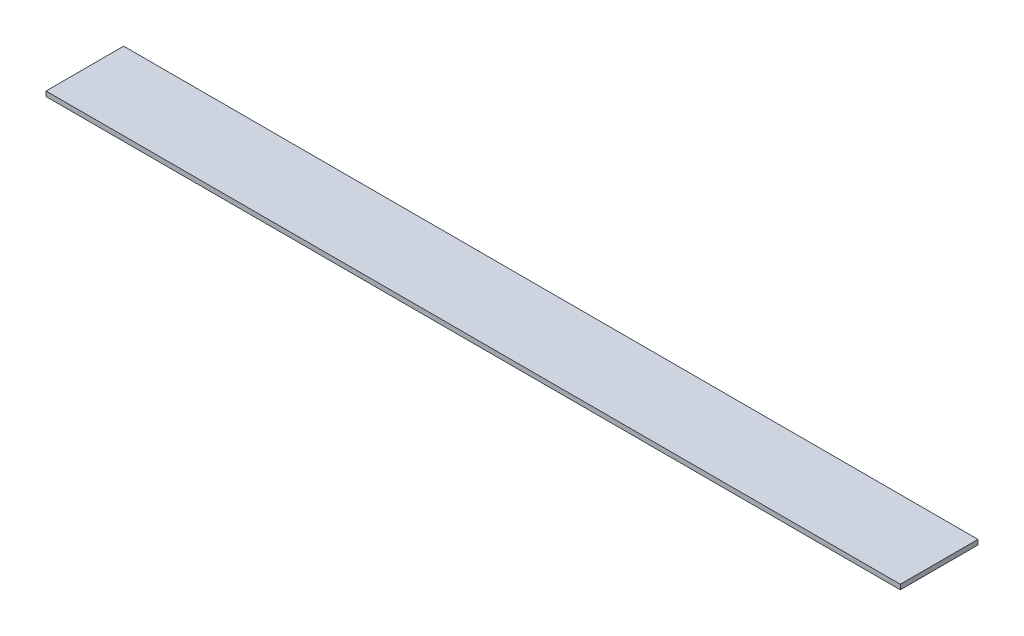
ISO-10303-21;
HEADER;
FILE_DESCRIPTION(('STEP AP214'),'2;1');
FILE_NAME('part.step','',(''),(''),'','','');
FILE_SCHEMA(('AUTOMOTIVE_DESIGN { 1 0 10303 214 1 1 1 1 }'));
ENDSEC;
DATA;
#1=APPLICATION_CONTEXT('core data for automotive mechanical design processes');
#2=APPLICATION_PROTOCOL_DEFINITION('international standard','automotive_design',2000,#1);
#3=PRODUCT_CONTEXT('',#1,'mechanical');
#4=PRODUCT('Part','Part','',(#3));
#5=PRODUCT_RELATED_PRODUCT_CATEGORY('part','',(#4));
#6=PRODUCT_DEFINITION_FORMATION('','',#4);
#7=PRODUCT_DEFINITION_CONTEXT('part definition',#1,'design');
#8=PRODUCT_DEFINITION('design','',#6,#7);
#9=PRODUCT_DEFINITION_SHAPE('','',#8);
#10=(LENGTH_UNIT() NAMED_UNIT(*) SI_UNIT(.MILLI.,.METRE.));
#11=(NAMED_UNIT(*) PLANE_ANGLE_UNIT() SI_UNIT($,.RADIAN.));
#12=(NAMED_UNIT(*) SI_UNIT($,.STERADIAN.) SOLID_ANGLE_UNIT());
#13=UNCERTAINTY_MEASURE_WITH_UNIT(LENGTH_MEASURE(1.E-05),#10,'distance_accuracy_value','');
#14=(GEOMETRIC_REPRESENTATION_CONTEXT(3) GLOBAL_UNCERTAINTY_ASSIGNED_CONTEXT((#13)) GLOBAL_UNIT_ASSIGNED_CONTEXT((#10,
#11,#12)) REPRESENTATION_CONTEXT('',''));
#15=CARTESIAN_POINT('',(0.,0.,0.));
#16=DIRECTION('',(0.,0.,1.));
#17=DIRECTION('',(1.,0.,0.));
#18=AXIS2_PLACEMENT_3D('',#15,#16,#17);
#19=CARTESIAN_POINT('',(0.,-83.437366020411,0.));
#20=DIRECTION('',(1.,0.,0.));
#21=DIRECTION('',(0.,0.,-1.));
#22=AXIS2_PLACEMENT_3D('',#19,#20,#21);
#23=PLANE('',#22);
#24=DIRECTION('',(0.,0.,-1.));
#25=VECTOR('',#24,1.);
#26=CARTESIAN_POINT('',(0.,-80.262366020411,0.));
#27=LINE('',#26,#25);
#28=CARTESIAN_POINT('',(0.,-80.262366020411,50.8));
#29=VERTEX_POINT('',#28);
#30=CARTESIAN_POINT('',(0.,-80.262366020411,0.));
#31=VERTEX_POINT('',#30);
#32=EDGE_CURVE('E98',#29,#31,#27,.T.);
#33=ORIENTED_EDGE('',*,*,#32,.T.);
#34=DIRECTION('',(0.,1.,0.));
#35=VECTOR('',#34,1.);
#36=CARTESIAN_POINT('',(0.,-83.437366020411,0.));
#37=LINE('',#36,#35);
#38=CARTESIAN_POINT('',(0.,-83.437366020411,0.));
#39=VERTEX_POINT('',#38);
#40=EDGE_CURVE('E11',#39,#31,#37,.T.);
#41=ORIENTED_EDGE('',*,*,#40,.F.);
#42=DIRECTION('',(0.,0.,-1.));
#43=VECTOR('',#42,1.);
#44=CARTESIAN_POINT('',(0.,-83.437366020411,0.));
#45=LINE('',#44,#43);
#46=CARTESIAN_POINT('',(0.,-83.437366020411,50.8));
#47=VERTEX_POINT('',#46);
#48=EDGE_CURVE('E86',#47,#39,#45,.T.);
#49=ORIENTED_EDGE('',*,*,#48,.F.);
#50=DIRECTION('',(0.,1.,0.));
#51=VECTOR('',#50,1.);
#52=CARTESIAN_POINT('',(0.,-83.437366020411,50.8));
#53=LINE('',#52,#51);
#54=EDGE_CURVE('E94',#47,#29,#53,.T.);
#55=ORIENTED_EDGE('',*,*,#54,.T.);
#56=EDGE_LOOP('',(#33,#41,#49,#55));
#57=FACE_BOUND('',#56,.T.);
#58=ADVANCED_FACE('F35',(#57),#23,.F.);
#59=CARTESIAN_POINT('',(0.,-83.437366020411,0.));
#60=DIRECTION('',(0.,0.,1.));
#61=DIRECTION('',(1.,0.,0.));
#62=AXIS2_PLACEMENT_3D('',#59,#60,#61);
#63=PLANE('',#62);
#64=DIRECTION('',(1.,0.,0.));
#65=VECTOR('',#64,1.);
#66=CARTESIAN_POINT('',(0.,-80.262366020411,0.));
#67=LINE('',#66,#65);
#68=CARTESIAN_POINT('',(558.8,-80.262366020411,0.));
#69=VERTEX_POINT('',#68);
#70=EDGE_CURVE('E90',#31,#69,#67,.T.);
#71=ORIENTED_EDGE('',*,*,#70,.T.);
#72=DIRECTION('',(0.,1.,0.));
#73=VECTOR('',#72,1.);
#74=CARTESIAN_POINT('',(558.8,-83.437366020411,0.));
#75=LINE('',#74,#73);
#76=CARTESIAN_POINT('',(558.8,-83.437366020411,0.));
#77=VERTEX_POINT('',#76);
#78=EDGE_CURVE('E43',#77,#69,#75,.T.);
#79=ORIENTED_EDGE('',*,*,#78,.F.);
#80=DIRECTION('',(1.,0.,0.));
#81=VECTOR('',#80,1.);
#82=CARTESIAN_POINT('',(0.,-83.437366020411,0.));
#83=LINE('',#82,#81);
#84=EDGE_CURVE('E81',#39,#77,#83,.T.);
#85=ORIENTED_EDGE('',*,*,#84,.F.);
#86=ORIENTED_EDGE('',*,*,#40,.T.);
#87=EDGE_LOOP('',(#71,#79,#85,#86));
#88=FACE_BOUND('',#87,.T.);
#89=ADVANCED_FACE('F89',(#88),#63,.F.);
#90=CARTESIAN_POINT('',(558.8,-83.437366020411,0.));
#91=DIRECTION('',(-1.,0.,0.));
#92=DIRECTION('',(0.,0.,1.));
#93=AXIS2_PLACEMENT_3D('',#90,#91,#92);
#94=PLANE('',#93);
#95=DIRECTION('',(0.,0.,1.));
#96=VECTOR('',#95,1.);
#97=CARTESIAN_POINT('',(558.8,-80.262366020411,0.));
#98=LINE('',#97,#96);
#99=CARTESIAN_POINT('',(558.8,-80.262366020411,50.8));
#100=VERTEX_POINT('',#99);
#101=EDGE_CURVE('E68',#69,#100,#98,.T.);
#102=ORIENTED_EDGE('',*,*,#101,.T.);
#103=DIRECTION('',(0.,1.,0.));
#104=VECTOR('',#103,1.);
#105=CARTESIAN_POINT('',(558.8,-83.437366020411,50.8));
#106=LINE('',#105,#104);
#107=CARTESIAN_POINT('',(558.8,-83.437366020411,50.8));
#108=VERTEX_POINT('',#107);
#109=EDGE_CURVE('E91',#108,#100,#106,.T.);
#110=ORIENTED_EDGE('',*,*,#109,.F.);
#111=DIRECTION('',(0.,0.,1.));
#112=VECTOR('',#111,1.);
#113=CARTESIAN_POINT('',(558.8,-83.437366020411,0.));
#114=LINE('',#113,#112);
#115=EDGE_CURVE('E84',#77,#108,#114,.T.);
#116=ORIENTED_EDGE('',*,*,#115,.F.);
#117=ORIENTED_EDGE('',*,*,#78,.T.);
#118=EDGE_LOOP('',(#102,#110,#116,#117));
#119=FACE_BOUND('',#118,.T.);
#120=ADVANCED_FACE('F92',(#119),#94,.F.);
#121=CARTESIAN_POINT('',(0.,-83.437366020411,50.8));
#122=DIRECTION('',(0.,0.,-1.));
#123=DIRECTION('',(-1.,0.,0.));
#124=AXIS2_PLACEMENT_3D('',#121,#122,#123);
#125=PLANE('',#124);
#126=DIRECTION('',(-1.,0.,0.));
#127=VECTOR('',#126,1.);
#128=CARTESIAN_POINT('',(0.,-80.262366020411,50.8));
#129=LINE('',#128,#127);
#130=EDGE_CURVE('E74',#100,#29,#129,.T.);
#131=ORIENTED_EDGE('',*,*,#130,.T.);
#132=ORIENTED_EDGE('',*,*,#54,.F.);
#133=DIRECTION('',(-1.,0.,0.));
#134=VECTOR('',#133,1.);
#135=CARTESIAN_POINT('',(0.,-83.437366020411,50.8));
#136=LINE('',#135,#134);
#137=EDGE_CURVE('E51',#108,#47,#136,.T.);
#138=ORIENTED_EDGE('',*,*,#137,.F.);
#139=ORIENTED_EDGE('',*,*,#109,.T.);
#140=EDGE_LOOP('',(#131,#132,#138,#139));
#141=FACE_BOUND('',#140,.T.);
#142=ADVANCED_FACE('F105',(#141),#125,.F.);
#143=CARTESIAN_POINT('',(0.,-83.437366020411,0.));
#144=DIRECTION('',(0.,1.,0.));
#145=DIRECTION('',(0.,0.,1.));
#146=AXIS2_PLACEMENT_3D('',#143,#144,#145);
#147=PLANE('',#146);
#148=ORIENTED_EDGE('',*,*,#48,.T.);
#149=ORIENTED_EDGE('',*,*,#84,.T.);
#150=ORIENTED_EDGE('',*,*,#115,.T.);
#151=ORIENTED_EDGE('',*,*,#137,.T.);
#152=EDGE_LOOP('',(#148,#149,#150,#151));
#153=FACE_BOUND('',#152,.T.);
#154=ADVANCED_FACE('F82',(#153),#147,.F.);
#155=CARTESIAN_POINT('',(0.,-80.262366020411,0.));
#156=DIRECTION('',(0.,1.,0.));
#157=DIRECTION('',(0.,0.,1.));
#158=AXIS2_PLACEMENT_3D('',#155,#156,#157);
#159=PLANE('',#158);
#160=ORIENTED_EDGE('',*,*,#32,.F.);
#161=ORIENTED_EDGE('',*,*,#130,.F.);
#162=ORIENTED_EDGE('',*,*,#101,.F.);
#163=ORIENTED_EDGE('',*,*,#70,.F.);
#164=EDGE_LOOP('',(#160,#161,#162,#163));
#165=FACE_BOUND('',#164,.T.);
#166=ADVANCED_FACE('F108',(#165),#159,.T.);
#167=CLOSED_SHELL('',(#58,#89,#120,#142,#154,#166));
#168=MANIFOLD_SOLID_BREP('B2',#167);
#169=ADVANCED_BREP_SHAPE_REPRESENTATION('',(#18,#168),#14);
#170=SHAPE_DEFINITION_REPRESENTATION(#9,#169);
ENDSEC;
END-ISO-10303-21;
